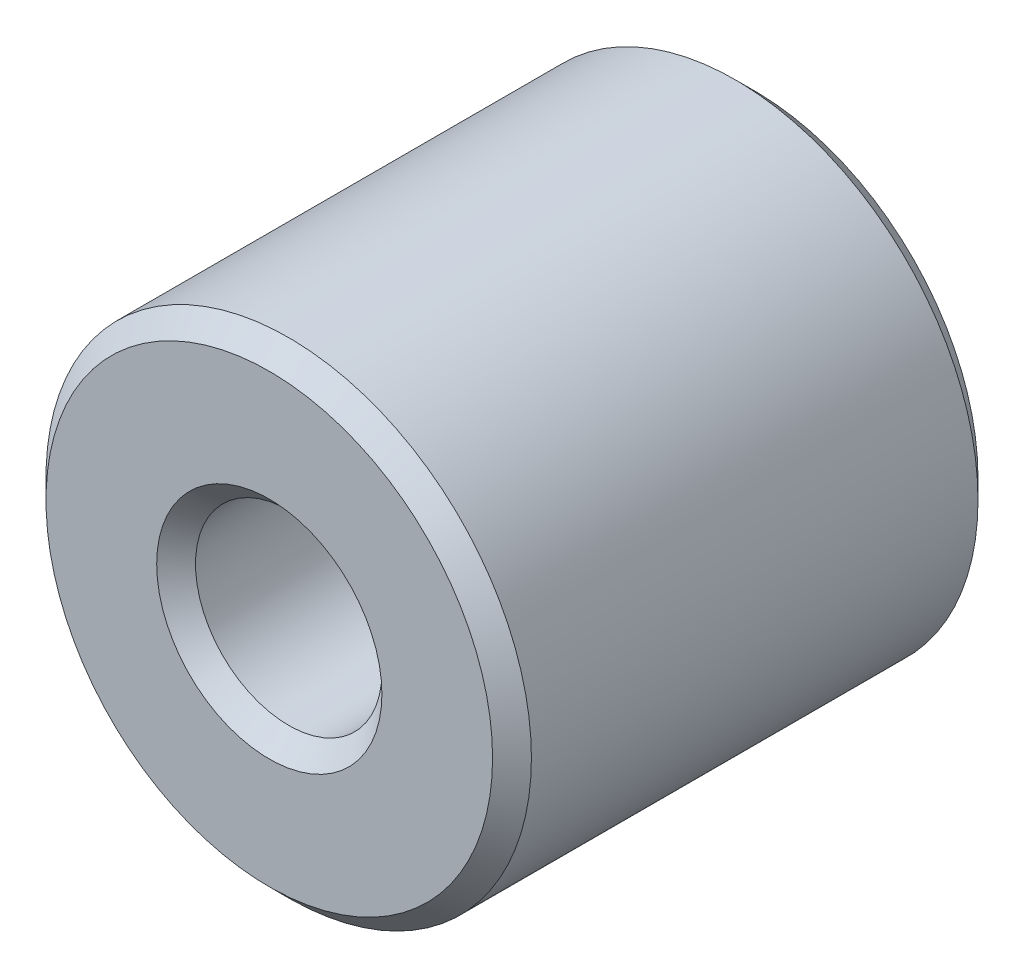
ISO-10303-21;
HEADER;
FILE_DESCRIPTION(('STEP AP214'),'2;1');
FILE_NAME('part.step','',(''),(''),'','','');
FILE_SCHEMA(('AUTOMOTIVE_DESIGN { 1 0 10303 214 1 1 1 1 }'));
ENDSEC;
DATA;
#1=APPLICATION_CONTEXT('core data for automotive mechanical design processes');
#2=APPLICATION_PROTOCOL_DEFINITION('international standard','automotive_design',2000,#1);
#3=PRODUCT_CONTEXT('',#1,'mechanical');
#4=PRODUCT('Part','Part','',(#3));
#5=PRODUCT_RELATED_PRODUCT_CATEGORY('part','',(#4));
#6=PRODUCT_DEFINITION_FORMATION('','',#4);
#7=PRODUCT_DEFINITION_CONTEXT('part definition',#1,'design');
#8=PRODUCT_DEFINITION('design','',#6,#7);
#9=PRODUCT_DEFINITION_SHAPE('','',#8);
#10=(LENGTH_UNIT() NAMED_UNIT(*) SI_UNIT(.MILLI.,.METRE.));
#11=(NAMED_UNIT(*) PLANE_ANGLE_UNIT() SI_UNIT($,.RADIAN.));
#12=(NAMED_UNIT(*) SI_UNIT($,.STERADIAN.) SOLID_ANGLE_UNIT());
#13=UNCERTAINTY_MEASURE_WITH_UNIT(LENGTH_MEASURE(1.E-05),#10,'distance_accuracy_value','');
#14=(GEOMETRIC_REPRESENTATION_CONTEXT(3) GLOBAL_UNCERTAINTY_ASSIGNED_CONTEXT((#13)) GLOBAL_UNIT_ASSIGNED_CONTEXT((#10,
#11,#12)) REPRESENTATION_CONTEXT('',''));
#15=CARTESIAN_POINT('',(0.,0.,0.));
#16=DIRECTION('',(0.,0.,1.));
#17=DIRECTION('',(1.,0.,0.));
#18=AXIS2_PLACEMENT_3D('',#15,#16,#17);
#19=CARTESIAN_POINT('',(0.,0.,-6.35));
#20=DIRECTION('',(0.,0.,1.));
#21=DIRECTION('',(1.,0.,0.));
#22=AXIS2_PLACEMENT_3D('',#19,#20,#21);
#23=CYLINDRICAL_SURFACE('',#22,6.35);
#24=CARTESIAN_POINT('',(0.,0.,-5.842));
#25=DIRECTION('',(0.,0.,1.));
#26=DIRECTION('',(1.,0.,0.));
#27=AXIS2_PLACEMENT_3D('',#24,#25,#26);
#28=CIRCLE('',#27,6.35);
#29=CARTESIAN_POINT('',(6.35,0.,-5.842));
#30=VERTEX_POINT('',#29);
#31=EDGE_CURVE('E10',#30,#30,#28,.T.);
#32=ORIENTED_EDGE('',*,*,#31,.T.);
#33=EDGE_LOOP('',(#32));
#34=FACE_BOUND('',#33,.T.);
#35=CARTESIAN_POINT('',(0.,0.,5.842));
#36=DIRECTION('',(0.,0.,1.));
#37=DIRECTION('',(1.,0.,0.));
#38=AXIS2_PLACEMENT_3D('',#35,#36,#37);
#39=CIRCLE('',#38,6.35);
#40=CARTESIAN_POINT('',(6.35,0.,5.842));
#41=VERTEX_POINT('',#40);
#42=EDGE_CURVE('E39',#41,#41,#39,.F.);
#43=ORIENTED_EDGE('',*,*,#42,.T.);
#44=EDGE_LOOP('',(#43));
#45=FACE_BOUND('',#44,.T.);
#46=ADVANCED_FACE('F32',(#34,#45),#23,.T.);
#47=CARTESIAN_POINT('',(0.,0.,-6.35));
#48=DIRECTION('',(0.,0.,1.));
#49=DIRECTION('',(1.,0.,0.));
#50=AXIS2_PLACEMENT_3D('',#47,#48,#49);
#51=PLANE('',#50);
#52=CARTESIAN_POINT('',(0.,0.,-6.35));
#53=DIRECTION('',(0.,0.,1.));
#54=DIRECTION('',(1.,0.,0.));
#55=AXIS2_PLACEMENT_3D('',#52,#53,#54);
#56=CIRCLE('',#55,2.94639999999999);
#57=CARTESIAN_POINT('',(2.94639999999999,0.,-6.35));
#58=VERTEX_POINT('',#57);
#59=EDGE_CURVE('E58',#58,#58,#56,.T.);
#60=ORIENTED_EDGE('',*,*,#59,.T.);
#61=EDGE_LOOP('',(#60));
#62=FACE_BOUND('',#61,.T.);
#63=CARTESIAN_POINT('',(0.,0.,-6.35));
#64=DIRECTION('',(0.,0.,1.));
#65=DIRECTION('',(1.,0.,0.));
#66=AXIS2_PLACEMENT_3D('',#63,#64,#65);
#67=CIRCLE('',#66,5.84199999999999);
#68=CARTESIAN_POINT('',(5.84199999999999,0.,-6.35));
#69=VERTEX_POINT('',#68);
#70=EDGE_CURVE('E61',#69,#69,#67,.F.);
#71=ORIENTED_EDGE('',*,*,#70,.T.);
#72=EDGE_LOOP('',(#71));
#73=FACE_BOUND('',#72,.T.);
#74=ADVANCED_FACE('F65',(#62,#73),#51,.F.);
#75=CARTESIAN_POINT('',(0.,0.,-6.35));
#76=DIRECTION('',(0.,0.,1.));
#77=DIRECTION('',(1.,0.,0.));
#78=AXIS2_PLACEMENT_3D('',#75,#76,#77);
#79=CYLINDRICAL_SURFACE('',#78,2.4384);
#80=CARTESIAN_POINT('',(0.,0.,-5.84200000000001));
#81=DIRECTION('',(0.,0.,1.));
#82=DIRECTION('',(1.,0.,0.));
#83=AXIS2_PLACEMENT_3D('',#80,#81,#82);
#84=CIRCLE('',#83,2.4384);
#85=CARTESIAN_POINT('',(2.4384,0.,-5.84200000000001));
#86=VERTEX_POINT('',#85);
#87=EDGE_CURVE('E52',#86,#86,#84,.F.);
#88=ORIENTED_EDGE('',*,*,#87,.T.);
#89=EDGE_LOOP('',(#88));
#90=FACE_BOUND('',#89,.T.);
#91=CARTESIAN_POINT('',(0.,0.,5.84199999999999));
#92=DIRECTION('',(0.,0.,1.));
#93=DIRECTION('',(1.,0.,0.));
#94=AXIS2_PLACEMENT_3D('',#91,#92,#93);
#95=CIRCLE('',#94,2.4384);
#96=CARTESIAN_POINT('',(2.4384,0.,5.84199999999999));
#97=VERTEX_POINT('',#96);
#98=EDGE_CURVE('E55',#97,#97,#95,.T.);
#99=ORIENTED_EDGE('',*,*,#98,.T.);
#100=EDGE_LOOP('',(#99));
#101=FACE_BOUND('',#100,.T.);
#102=ADVANCED_FACE('F84',(#90,#101),#79,.F.);
#103=CARTESIAN_POINT('',(0.,0.,6.35));
#104=DIRECTION('',(0.,0.,1.));
#105=DIRECTION('',(1.,0.,0.));
#106=AXIS2_PLACEMENT_3D('',#103,#104,#105);
#107=PLANE('',#106);
#108=CARTESIAN_POINT('',(0.,0.,6.35));
#109=DIRECTION('',(0.,0.,1.));
#110=DIRECTION('',(1.,0.,0.));
#111=AXIS2_PLACEMENT_3D('',#108,#109,#110);
#112=CIRCLE('',#111,2.94640000000001);
#113=CARTESIAN_POINT('',(2.94640000000001,0.,6.35));
#114=VERTEX_POINT('',#113);
#115=EDGE_CURVE('E43',#114,#114,#112,.F.);
#116=ORIENTED_EDGE('',*,*,#115,.T.);
#117=EDGE_LOOP('',(#116));
#118=FACE_BOUND('',#117,.T.);
#119=CARTESIAN_POINT('',(0.,0.,6.35));
#120=DIRECTION('',(0.,0.,1.));
#121=DIRECTION('',(1.,0.,0.));
#122=AXIS2_PLACEMENT_3D('',#119,#120,#121);
#123=CIRCLE('',#122,5.842);
#124=CARTESIAN_POINT('',(5.842,0.,6.35));
#125=VERTEX_POINT('',#124);
#126=EDGE_CURVE('E47',#125,#125,#123,.T.);
#127=ORIENTED_EDGE('',*,*,#126,.T.);
#128=EDGE_LOOP('',(#127));
#129=FACE_BOUND('',#128,.T.);
#130=ADVANCED_FACE('F90',(#118,#129),#107,.T.);
#131=CARTESIAN_POINT('',(0.,0.,-6.35));
#132=DIRECTION('',(0.,0.,-1.));
#133=DIRECTION('',(-1.,0.,0.));
#134=AXIS2_PLACEMENT_3D('',#131,#132,#133);
#135=CONICAL_SURFACE('',#134,2.94639999999999,0.785398163397446);
#136=ORIENTED_EDGE('',*,*,#87,.F.);
#137=EDGE_LOOP('',(#136));
#138=FACE_BOUND('',#137,.T.);
#139=ORIENTED_EDGE('',*,*,#59,.F.);
#140=EDGE_LOOP('',(#139));
#141=FACE_BOUND('',#140,.T.);
#142=ADVANCED_FACE('F76',(#138,#141),#135,.F.);
#143=CARTESIAN_POINT('',(0.,0.,5.84199999999999));
#144=DIRECTION('',(0.,0.,1.));
#145=DIRECTION('',(1.,0.,0.));
#146=AXIS2_PLACEMENT_3D('',#143,#144,#145);
#147=CONICAL_SURFACE('',#146,2.4384,0.785398163397448);
#148=ORIENTED_EDGE('',*,*,#115,.F.);
#149=EDGE_LOOP('',(#148));
#150=FACE_BOUND('',#149,.T.);
#151=ORIENTED_EDGE('',*,*,#98,.F.);
#152=EDGE_LOOP('',(#151));
#153=FACE_BOUND('',#152,.T.);
#154=ADVANCED_FACE('F70',(#150,#153),#147,.F.);
#155=CARTESIAN_POINT('',(0.,0.,-5.842));
#156=DIRECTION('',(0.,0.,1.));
#157=DIRECTION('',(1.,0.,0.));
#158=AXIS2_PLACEMENT_3D('',#155,#156,#157);
#159=CONICAL_SURFACE('',#158,6.35,0.785398163397449);
#160=ORIENTED_EDGE('',*,*,#70,.F.);
#161=EDGE_LOOP('',(#160));
#162=FACE_BOUND('',#161,.T.);
#163=ORIENTED_EDGE('',*,*,#31,.F.);
#164=EDGE_LOOP('',(#163));
#165=FACE_BOUND('',#164,.T.);
#166=ADVANCED_FACE('F67',(#162,#165),#159,.T.);
#167=CARTESIAN_POINT('',(0.,0.,6.35));
#168=DIRECTION('',(0.,0.,-1.));
#169=DIRECTION('',(-1.,0.,0.));
#170=AXIS2_PLACEMENT_3D('',#167,#168,#169);
#171=CONICAL_SURFACE('',#170,5.842,0.785398163397447);
#172=ORIENTED_EDGE('',*,*,#42,.F.);
#173=EDGE_LOOP('',(#172));
#174=FACE_BOUND('',#173,.T.);
#175=ORIENTED_EDGE('',*,*,#126,.F.);
#176=EDGE_LOOP('',(#175));
#177=FACE_BOUND('',#176,.T.);
#178=ADVANCED_FACE('F34',(#174,#177),#171,.T.);
#179=CLOSED_SHELL('',(#46,#74,#102,#130,#142,#154,#166,#178));
#180=MANIFOLD_SOLID_BREP('B2',#179);
#181=ADVANCED_BREP_SHAPE_REPRESENTATION('',(#18,#180),#14);
#182=SHAPE_DEFINITION_REPRESENTATION(#9,#181);
ENDSEC;
END-ISO-10303-21;
